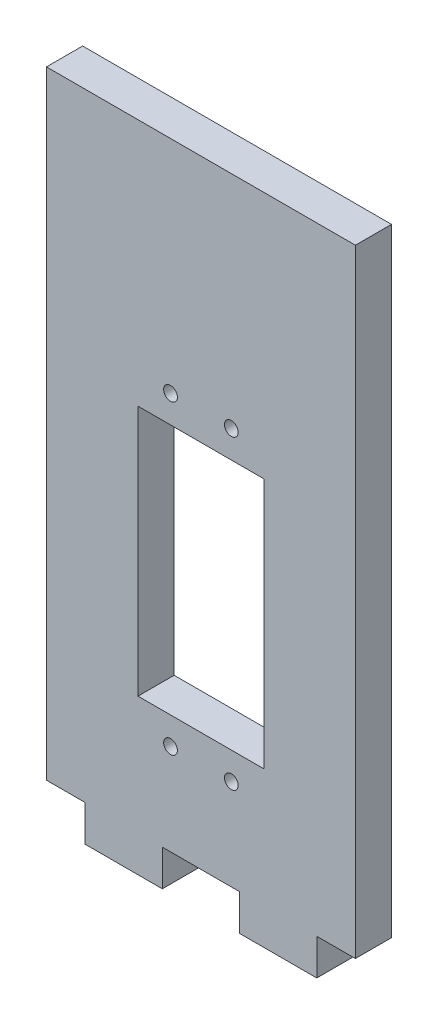
ISO-10303-21;
HEADER;
FILE_DESCRIPTION(('STEP AP214'),'2;1');
FILE_NAME('part.step','',(''),(''),'','','');
FILE_SCHEMA(('AUTOMOTIVE_DESIGN { 1 0 10303 214 1 1 1 1 }'));
ENDSEC;
DATA;
#1=APPLICATION_CONTEXT('core data for automotive mechanical design processes');
#2=APPLICATION_PROTOCOL_DEFINITION('international standard','automotive_design',2000,#1);
#3=PRODUCT_CONTEXT('',#1,'mechanical');
#4=PRODUCT('Part','Part','',(#3));
#5=PRODUCT_RELATED_PRODUCT_CATEGORY('part','',(#4));
#6=PRODUCT_DEFINITION_FORMATION('','',#4);
#7=PRODUCT_DEFINITION_CONTEXT('part definition',#1,'design');
#8=PRODUCT_DEFINITION('design','',#6,#7);
#9=PRODUCT_DEFINITION_SHAPE('','',#8);
#10=(LENGTH_UNIT() NAMED_UNIT(*) SI_UNIT(.MILLI.,.METRE.));
#11=(NAMED_UNIT(*) PLANE_ANGLE_UNIT() SI_UNIT($,.RADIAN.));
#12=(NAMED_UNIT(*) SI_UNIT($,.STERADIAN.) SOLID_ANGLE_UNIT());
#13=UNCERTAINTY_MEASURE_WITH_UNIT(LENGTH_MEASURE(1.E-05),#10,'distance_accuracy_value','');
#14=(GEOMETRIC_REPRESENTATION_CONTEXT(3) GLOBAL_UNCERTAINTY_ASSIGNED_CONTEXT((#13)) GLOBAL_UNIT_ASSIGNED_CONTEXT((#10,
#11,#12)) REPRESENTATION_CONTEXT('',''));
#15=CARTESIAN_POINT('',(0.,0.,0.));
#16=DIRECTION('',(0.,0.,1.));
#17=DIRECTION('',(1.,0.,0.));
#18=AXIS2_PLACEMENT_3D('',#15,#16,#17);
#19=CARTESIAN_POINT('',(0.,0.,5.9436));
#20=DIRECTION('',(1.,0.,0.));
#21=DIRECTION('',(0.,0.,-1.));
#22=AXIS2_PLACEMENT_3D('',#19,#20,#21);
#23=PLANE('',#22);
#24=DIRECTION('',(0.,-1.,0.));
#25=VECTOR('',#24,1.);
#26=CARTESIAN_POINT('',(0.,0.,0.));
#27=LINE('',#26,#25);
#28=CARTESIAN_POINT('',(0.,101.6,0.));
#29=VERTEX_POINT('',#28);
#30=CARTESIAN_POINT('',(0.,0.,0.));
#31=VERTEX_POINT('',#30);
#32=EDGE_CURVE('E181',#29,#31,#27,.T.);
#33=ORIENTED_EDGE('',*,*,#32,.T.);
#34=DIRECTION('',(0.,0.,-1.));
#35=VECTOR('',#34,1.);
#36=CARTESIAN_POINT('',(0.,0.,5.9436));
#37=LINE('',#36,#35);
#38=CARTESIAN_POINT('',(0.,0.,5.9436));
#39=VERTEX_POINT('',#38);
#40=EDGE_CURVE('E11',#39,#31,#37,.T.);
#41=ORIENTED_EDGE('',*,*,#40,.F.);
#42=DIRECTION('',(0.,-1.,0.));
#43=VECTOR('',#42,1.);
#44=CARTESIAN_POINT('',(0.,0.,5.9436));
#45=LINE('',#44,#43);
#46=CARTESIAN_POINT('',(0.,101.6,5.9436));
#47=VERTEX_POINT('',#46);
#48=EDGE_CURVE('E185',#47,#39,#45,.T.);
#49=ORIENTED_EDGE('',*,*,#48,.F.);
#50=DIRECTION('',(0.,0.,-1.));
#51=VECTOR('',#50,1.);
#52=CARTESIAN_POINT('',(0.,101.6,5.9436));
#53=LINE('',#52,#51);
#54=EDGE_CURVE('E211',#47,#29,#53,.T.);
#55=ORIENTED_EDGE('',*,*,#54,.T.);
#56=EDGE_LOOP('',(#33,#41,#49,#55));
#57=FACE_BOUND('',#56,.T.);
#58=ADVANCED_FACE('F32',(#57),#23,.F.);
#59=CARTESIAN_POINT('',(0.,0.,5.9436));
#60=DIRECTION('',(0.,1.,0.));
#61=DIRECTION('',(0.,0.,1.));
#62=AXIS2_PLACEMENT_3D('',#59,#60,#61);
#63=PLANE('',#62);
#64=DIRECTION('',(1.,0.,0.));
#65=VECTOR('',#64,1.);
#66=CARTESIAN_POINT('',(0.,0.,0.));
#67=LINE('',#66,#65);
#68=CARTESIAN_POINT('',(6.35,0.,0.));
#69=VERTEX_POINT('',#68);
#70=EDGE_CURVE('E214',#31,#69,#67,.T.);
#71=ORIENTED_EDGE('',*,*,#70,.T.);
#72=DIRECTION('',(0.,0.,-1.));
#73=VECTOR('',#72,1.);
#74=CARTESIAN_POINT('',(6.35,0.,5.9436));
#75=LINE('',#74,#73);
#76=CARTESIAN_POINT('',(6.35,0.,5.9436));
#77=VERTEX_POINT('',#76);
#78=EDGE_CURVE('E39',#77,#69,#75,.T.);
#79=ORIENTED_EDGE('',*,*,#78,.F.);
#80=DIRECTION('',(1.,0.,0.));
#81=VECTOR('',#80,1.);
#82=CARTESIAN_POINT('',(0.,0.,5.9436));
#83=LINE('',#82,#81);
#84=EDGE_CURVE('E188',#39,#77,#83,.T.);
#85=ORIENTED_EDGE('',*,*,#84,.F.);
#86=ORIENTED_EDGE('',*,*,#40,.T.);
#87=EDGE_LOOP('',(#71,#79,#85,#86));
#88=FACE_BOUND('',#87,.T.);
#89=ADVANCED_FACE('F289',(#88),#63,.F.);
#90=CARTESIAN_POINT('',(6.35,0.,5.9436));
#91=DIRECTION('',(1.,0.,0.));
#92=DIRECTION('',(0.,1.,0.));
#93=AXIS2_PLACEMENT_3D('',#90,#91,#92);
#94=PLANE('',#93);
#95=DIRECTION('',(0.,-1.,0.));
#96=VECTOR('',#95,1.);
#97=CARTESIAN_POINT('',(6.35,0.,0.));
#98=LINE('',#97,#96);
#99=CARTESIAN_POINT('',(6.35,-5.9436,0.));
#100=VERTEX_POINT('',#99);
#101=EDGE_CURVE('E216',#69,#100,#98,.T.);
#102=ORIENTED_EDGE('',*,*,#101,.T.);
#103=DIRECTION('',(0.,0.,-1.));
#104=VECTOR('',#103,1.);
#105=CARTESIAN_POINT('',(6.35,-5.9436,5.9436));
#106=LINE('',#105,#104);
#107=CARTESIAN_POINT('',(6.35,-5.9436,5.9436));
#108=VERTEX_POINT('',#107);
#109=EDGE_CURVE('E261',#108,#100,#106,.T.);
#110=ORIENTED_EDGE('',*,*,#109,.F.);
#111=DIRECTION('',(0.,-1.,0.));
#112=VECTOR('',#111,1.);
#113=CARTESIAN_POINT('',(6.35,0.,5.9436));
#114=LINE('',#113,#112);
#115=EDGE_CURVE('E191',#77,#108,#114,.T.);
#116=ORIENTED_EDGE('',*,*,#115,.F.);
#117=ORIENTED_EDGE('',*,*,#78,.T.);
#118=EDGE_LOOP('',(#102,#110,#116,#117));
#119=FACE_BOUND('',#118,.T.);
#120=ADVANCED_FACE('F268',(#119),#94,.F.);
#121=CARTESIAN_POINT('',(6.35,-5.9436,5.9436));
#122=DIRECTION('',(0.,1.,0.));
#123=DIRECTION('',(-1.,0.,0.));
#124=AXIS2_PLACEMENT_3D('',#121,#122,#123);
#125=PLANE('',#124);
#126=DIRECTION('',(1.,0.,0.));
#127=VECTOR('',#126,1.);
#128=CARTESIAN_POINT('',(6.35,-5.9436,0.));
#129=LINE('',#128,#127);
#130=CARTESIAN_POINT('',(19.05,-5.9436,0.));
#131=VERTEX_POINT('',#130);
#132=EDGE_CURVE('E218',#100,#131,#129,.T.);
#133=ORIENTED_EDGE('',*,*,#132,.T.);
#134=DIRECTION('',(0.,0.,-1.));
#135=VECTOR('',#134,1.);
#136=CARTESIAN_POINT('',(19.05,-5.9436,5.9436));
#137=LINE('',#136,#135);
#138=CARTESIAN_POINT('',(19.05,-5.9436,5.9436));
#139=VERTEX_POINT('',#138);
#140=EDGE_CURVE('E258',#139,#131,#137,.T.);
#141=ORIENTED_EDGE('',*,*,#140,.F.);
#142=DIRECTION('',(1.,0.,0.));
#143=VECTOR('',#142,1.);
#144=CARTESIAN_POINT('',(6.35,-5.9436,5.9436));
#145=LINE('',#144,#143);
#146=EDGE_CURVE('E193',#108,#139,#145,.T.);
#147=ORIENTED_EDGE('',*,*,#146,.F.);
#148=ORIENTED_EDGE('',*,*,#109,.T.);
#149=EDGE_LOOP('',(#133,#141,#147,#148));
#150=FACE_BOUND('',#149,.T.);
#151=ADVANCED_FACE('F277',(#150),#125,.F.);
#152=CARTESIAN_POINT('',(19.05,-5.9436,5.9436));
#153=DIRECTION('',(-1.,0.,0.));
#154=DIRECTION('',(0.,0.,1.));
#155=AXIS2_PLACEMENT_3D('',#152,#153,#154);
#156=PLANE('',#155);
#157=DIRECTION('',(0.,1.,0.));
#158=VECTOR('',#157,1.);
#159=CARTESIAN_POINT('',(19.05,-5.9436,0.));
#160=LINE('',#159,#158);
#161=CARTESIAN_POINT('',(19.05,0.,0.));
#162=VERTEX_POINT('',#161);
#163=EDGE_CURVE('E220',#131,#162,#160,.T.);
#164=ORIENTED_EDGE('',*,*,#163,.T.);
#165=DIRECTION('',(0.,0.,-1.));
#166=VECTOR('',#165,1.);
#167=CARTESIAN_POINT('',(19.05,0.,5.9436));
#168=LINE('',#167,#166);
#169=CARTESIAN_POINT('',(19.05,0.,5.9436));
#170=VERTEX_POINT('',#169);
#171=EDGE_CURVE('E255',#170,#162,#168,.T.);
#172=ORIENTED_EDGE('',*,*,#171,.F.);
#173=DIRECTION('',(0.,1.,0.));
#174=VECTOR('',#173,1.);
#175=CARTESIAN_POINT('',(19.05,-5.9436,5.9436));
#176=LINE('',#175,#174);
#177=EDGE_CURVE('E195',#139,#170,#176,.T.);
#178=ORIENTED_EDGE('',*,*,#177,.F.);
#179=ORIENTED_EDGE('',*,*,#140,.T.);
#180=EDGE_LOOP('',(#164,#172,#178,#179));
#181=FACE_BOUND('',#180,.T.);
#182=ADVANCED_FACE('F281',(#181),#156,.F.);
#183=CARTESIAN_POINT('',(19.05,0.,5.9436));
#184=DIRECTION('',(0.,1.,0.));
#185=DIRECTION('',(0.,0.,1.));
#186=AXIS2_PLACEMENT_3D('',#183,#184,#185);
#187=PLANE('',#186);
#188=DIRECTION('',(1.,0.,0.));
#189=VECTOR('',#188,1.);
#190=CARTESIAN_POINT('',(19.05,0.,0.));
#191=LINE('',#190,#189);
#192=CARTESIAN_POINT('',(31.75,0.,0.));
#193=VERTEX_POINT('',#192);
#194=EDGE_CURVE('E222',#162,#193,#191,.T.);
#195=ORIENTED_EDGE('',*,*,#194,.T.);
#196=DIRECTION('',(0.,0.,-1.));
#197=VECTOR('',#196,1.);
#198=CARTESIAN_POINT('',(31.75,0.,5.9436));
#199=LINE('',#198,#197);
#200=CARTESIAN_POINT('',(31.75,0.,5.9436));
#201=VERTEX_POINT('',#200);
#202=EDGE_CURVE('E252',#201,#193,#199,.T.);
#203=ORIENTED_EDGE('',*,*,#202,.F.);
#204=DIRECTION('',(1.,0.,0.));
#205=VECTOR('',#204,1.);
#206=CARTESIAN_POINT('',(19.05,0.,5.9436));
#207=LINE('',#206,#205);
#208=EDGE_CURVE('E197',#170,#201,#207,.T.);
#209=ORIENTED_EDGE('',*,*,#208,.F.);
#210=ORIENTED_EDGE('',*,*,#171,.T.);
#211=EDGE_LOOP('',(#195,#203,#209,#210));
#212=FACE_BOUND('',#211,.T.);
#213=ADVANCED_FACE('F322',(#212),#187,.F.);
#214=CARTESIAN_POINT('',(31.75,-5.9436,5.9436));
#215=DIRECTION('',(1.,0.,0.));
#216=DIRECTION('',(0.,0.,-1.));
#217=AXIS2_PLACEMENT_3D('',#214,#215,#216);
#218=PLANE('',#217);
#219=DIRECTION('',(0.,-1.,0.));
#220=VECTOR('',#219,1.);
#221=CARTESIAN_POINT('',(31.75,-5.9436,0.));
#222=LINE('',#221,#220);
#223=CARTESIAN_POINT('',(31.75,-5.9436,0.));
#224=VERTEX_POINT('',#223);
#225=EDGE_CURVE('E224',#193,#224,#222,.T.);
#226=ORIENTED_EDGE('',*,*,#225,.T.);
#227=DIRECTION('',(0.,0.,-1.));
#228=VECTOR('',#227,1.);
#229=CARTESIAN_POINT('',(31.75,-5.9436,5.9436));
#230=LINE('',#229,#228);
#231=CARTESIAN_POINT('',(31.75,-5.9436,5.9436));
#232=VERTEX_POINT('',#231);
#233=EDGE_CURVE('E249',#232,#224,#230,.T.);
#234=ORIENTED_EDGE('',*,*,#233,.F.);
#235=DIRECTION('',(0.,-1.,0.));
#236=VECTOR('',#235,1.);
#237=CARTESIAN_POINT('',(31.75,-5.9436,5.9436));
#238=LINE('',#237,#236);
#239=EDGE_CURVE('E199',#201,#232,#238,.T.);
#240=ORIENTED_EDGE('',*,*,#239,.F.);
#241=ORIENTED_EDGE('',*,*,#202,.T.);
#242=EDGE_LOOP('',(#226,#234,#240,#241));
#243=FACE_BOUND('',#242,.T.);
#244=ADVANCED_FACE('F320',(#243),#218,.F.);
#245=CARTESIAN_POINT('',(44.45,-5.9436,5.9436));
#246=DIRECTION('',(0.,1.,0.));
#247=DIRECTION('',(-1.,0.,0.));
#248=AXIS2_PLACEMENT_3D('',#245,#246,#247);
#249=PLANE('',#248);
#250=DIRECTION('',(1.,0.,0.));
#251=VECTOR('',#250,1.);
#252=CARTESIAN_POINT('',(44.45,-5.9436,0.));
#253=LINE('',#252,#251);
#254=CARTESIAN_POINT('',(44.45,-5.9436,0.));
#255=VERTEX_POINT('',#254);
#256=EDGE_CURVE('E226',#224,#255,#253,.T.);
#257=ORIENTED_EDGE('',*,*,#256,.T.);
#258=DIRECTION('',(0.,0.,-1.));
#259=VECTOR('',#258,1.);
#260=CARTESIAN_POINT('',(44.45,-5.9436,5.9436));
#261=LINE('',#260,#259);
#262=CARTESIAN_POINT('',(44.45,-5.9436,5.9436));
#263=VERTEX_POINT('',#262);
#264=EDGE_CURVE('E246',#263,#255,#261,.T.);
#265=ORIENTED_EDGE('',*,*,#264,.F.);
#266=DIRECTION('',(1.,0.,0.));
#267=VECTOR('',#266,1.);
#268=CARTESIAN_POINT('',(44.45,-5.9436,5.9436));
#269=LINE('',#268,#267);
#270=EDGE_CURVE('E201',#232,#263,#269,.T.);
#271=ORIENTED_EDGE('',*,*,#270,.F.);
#272=ORIENTED_EDGE('',*,*,#233,.T.);
#273=EDGE_LOOP('',(#257,#265,#271,#272));
#274=FACE_BOUND('',#273,.T.);
#275=ADVANCED_FACE('F316',(#274),#249,.F.);
#276=CARTESIAN_POINT('',(44.45,0.,5.9436));
#277=DIRECTION('',(-1.,0.,0.));
#278=DIRECTION('',(0.,0.,1.));
#279=AXIS2_PLACEMENT_3D('',#276,#277,#278);
#280=PLANE('',#279);
#281=DIRECTION('',(0.,1.,0.));
#282=VECTOR('',#281,1.);
#283=CARTESIAN_POINT('',(44.45,0.,0.));
#284=LINE('',#283,#282);
#285=CARTESIAN_POINT('',(44.45,0.,0.));
#286=VERTEX_POINT('',#285);
#287=EDGE_CURVE('E228',#255,#286,#284,.T.);
#288=ORIENTED_EDGE('',*,*,#287,.T.);
#289=DIRECTION('',(0.,0.,-1.));
#290=VECTOR('',#289,1.);
#291=CARTESIAN_POINT('',(44.45,0.,5.9436));
#292=LINE('',#291,#290);
#293=CARTESIAN_POINT('',(44.45,0.,5.9436));
#294=VERTEX_POINT('',#293);
#295=EDGE_CURVE('E243',#294,#286,#292,.T.);
#296=ORIENTED_EDGE('',*,*,#295,.F.);
#297=DIRECTION('',(0.,1.,0.));
#298=VECTOR('',#297,1.);
#299=CARTESIAN_POINT('',(44.45,0.,5.9436));
#300=LINE('',#299,#298);
#301=EDGE_CURVE('E203',#263,#294,#300,.T.);
#302=ORIENTED_EDGE('',*,*,#301,.F.);
#303=ORIENTED_EDGE('',*,*,#264,.T.);
#304=EDGE_LOOP('',(#288,#296,#302,#303));
#305=FACE_BOUND('',#304,.T.);
#306=ADVANCED_FACE('F311',(#305),#280,.F.);
#307=CARTESIAN_POINT('',(44.45,0.,5.9436));
#308=DIRECTION('',(0.,1.,0.));
#309=DIRECTION('',(0.,0.,1.));
#310=AXIS2_PLACEMENT_3D('',#307,#308,#309);
#311=PLANE('',#310);
#312=DIRECTION('',(1.,0.,0.));
#313=VECTOR('',#312,1.);
#314=CARTESIAN_POINT('',(44.45,0.,0.));
#315=LINE('',#314,#313);
#316=CARTESIAN_POINT('',(50.8,0.,0.));
#317=VERTEX_POINT('',#316);
#318=EDGE_CURVE('E230',#286,#317,#315,.T.);
#319=ORIENTED_EDGE('',*,*,#318,.T.);
#320=DIRECTION('',(0.,0.,-1.));
#321=VECTOR('',#320,1.);
#322=CARTESIAN_POINT('',(50.8,0.,5.9436));
#323=LINE('',#322,#321);
#324=CARTESIAN_POINT('',(50.8,0.,5.9436));
#325=VERTEX_POINT('',#324);
#326=EDGE_CURVE('E240',#325,#317,#323,.T.);
#327=ORIENTED_EDGE('',*,*,#326,.F.);
#328=DIRECTION('',(1.,0.,0.));
#329=VECTOR('',#328,1.);
#330=CARTESIAN_POINT('',(44.45,0.,5.9436));
#331=LINE('',#330,#329);
#332=EDGE_CURVE('E205',#294,#325,#331,.T.);
#333=ORIENTED_EDGE('',*,*,#332,.F.);
#334=ORIENTED_EDGE('',*,*,#295,.T.);
#335=EDGE_LOOP('',(#319,#327,#333,#334));
#336=FACE_BOUND('',#335,.T.);
#337=ADVANCED_FACE('F305',(#336),#311,.F.);
#338=CARTESIAN_POINT('',(50.8,0.,5.9436));
#339=DIRECTION('',(-1.,0.,0.));
#340=DIRECTION('',(0.,-1.,0.));
#341=AXIS2_PLACEMENT_3D('',#338,#339,#340);
#342=PLANE('',#341);
#343=DIRECTION('',(0.,1.,0.));
#344=VECTOR('',#343,1.);
#345=CARTESIAN_POINT('',(50.8,0.,0.));
#346=LINE('',#345,#344);
#347=CARTESIAN_POINT('',(50.8,101.6,0.));
#348=VERTEX_POINT('',#347);
#349=EDGE_CURVE('E232',#317,#348,#346,.T.);
#350=ORIENTED_EDGE('',*,*,#349,.T.);
#351=DIRECTION('',(0.,0.,-1.));
#352=VECTOR('',#351,1.);
#353=CARTESIAN_POINT('',(50.8,101.6,5.9436));
#354=LINE('',#353,#352);
#355=CARTESIAN_POINT('',(50.8,101.6,5.9436));
#356=VERTEX_POINT('',#355);
#357=EDGE_CURVE('E237',#356,#348,#354,.T.);
#358=ORIENTED_EDGE('',*,*,#357,.F.);
#359=DIRECTION('',(0.,1.,0.));
#360=VECTOR('',#359,1.);
#361=CARTESIAN_POINT('',(50.8,0.,5.9436));
#362=LINE('',#361,#360);
#363=EDGE_CURVE('E207',#325,#356,#362,.T.);
#364=ORIENTED_EDGE('',*,*,#363,.F.);
#365=ORIENTED_EDGE('',*,*,#326,.T.);
#366=EDGE_LOOP('',(#350,#358,#364,#365));
#367=FACE_BOUND('',#366,.T.);
#368=ADVANCED_FACE('F301',(#367),#342,.F.);
#369=CARTESIAN_POINT('',(0.,101.6,5.9436));
#370=DIRECTION('',(0.,-1.,0.));
#371=DIRECTION('',(0.,0.,-1.));
#372=AXIS2_PLACEMENT_3D('',#369,#370,#371);
#373=PLANE('',#372);
#374=DIRECTION('',(-1.,0.,0.));
#375=VECTOR('',#374,1.);
#376=CARTESIAN_POINT('',(0.,101.6,0.));
#377=LINE('',#376,#375);
#378=EDGE_CURVE('E189',#348,#29,#377,.T.);
#379=ORIENTED_EDGE('',*,*,#378,.T.);
#380=ORIENTED_EDGE('',*,*,#54,.F.);
#381=DIRECTION('',(-1.,0.,0.));
#382=VECTOR('',#381,1.);
#383=CARTESIAN_POINT('',(0.,101.6,5.9436));
#384=LINE('',#383,#382);
#385=EDGE_CURVE('E209',#356,#47,#384,.T.);
#386=ORIENTED_EDGE('',*,*,#385,.F.);
#387=ORIENTED_EDGE('',*,*,#357,.T.);
#388=EDGE_LOOP('',(#379,#380,#386,#387));
#389=FACE_BOUND('',#388,.T.);
#390=ADVANCED_FACE('F296',(#389),#373,.F.);
#391=CARTESIAN_POINT('',(0.,0.,5.9436));
#392=DIRECTION('',(0.,0.,-1.));
#393=DIRECTION('',(-1.,0.,0.));
#394=AXIS2_PLACEMENT_3D('',#391,#392,#393);
#395=PLANE('',#394);
#396=CARTESIAN_POINT('',(30.4,15.,5.9436));
#397=DIRECTION('',(0.,0.,1.));
#398=DIRECTION('',(1.,0.,0.));
#399=AXIS2_PLACEMENT_3D('',#396,#397,#398);
#400=CIRCLE('',#399,1.13030000000002);
#401=CARTESIAN_POINT('',(31.5303,15.,5.9436));
#402=VERTEX_POINT('',#401);
#403=EDGE_CURVE('E168',#402,#402,#400,.T.);
#404=ORIENTED_EDGE('',*,*,#403,.F.);
#405=EDGE_LOOP('',(#404));
#406=FACE_BOUND('',#405,.T.);
#407=CARTESIAN_POINT('',(20.4,15.,5.9436));
#408=DIRECTION('',(0.,0.,1.));
#409=DIRECTION('',(1.,0.,0.));
#410=AXIS2_PLACEMENT_3D('',#407,#408,#409);
#411=CIRCLE('',#410,1.1303);
#412=CARTESIAN_POINT('',(21.5303,15.,5.9436));
#413=VERTEX_POINT('',#412);
#414=EDGE_CURVE('E502',#413,#413,#411,.T.);
#415=ORIENTED_EDGE('',*,*,#414,.F.);
#416=EDGE_LOOP('',(#415));
#417=FACE_BOUND('',#416,.T.);
#418=CARTESIAN_POINT('',(30.4,65.3,5.9436));
#419=DIRECTION('',(0.,0.,1.));
#420=DIRECTION('',(1.,0.,0.));
#421=AXIS2_PLACEMENT_3D('',#418,#419,#420);
#422=CIRCLE('',#421,1.13030000000002);
#423=CARTESIAN_POINT('',(31.5303,65.3,5.9436));
#424=VERTEX_POINT('',#423);
#425=EDGE_CURVE('E509',#424,#424,#422,.T.);
#426=ORIENTED_EDGE('',*,*,#425,.F.);
#427=EDGE_LOOP('',(#426));
#428=FACE_BOUND('',#427,.T.);
#429=CARTESIAN_POINT('',(20.4,65.3,5.9436));
#430=DIRECTION('',(0.,0.,1.));
#431=DIRECTION('',(1.,0.,0.));
#432=AXIS2_PLACEMENT_3D('',#429,#430,#431);
#433=CIRCLE('',#432,1.1303);
#434=CARTESIAN_POINT('',(21.5303,65.3,5.9436));
#435=VERTEX_POINT('',#434);
#436=EDGE_CURVE('E515',#435,#435,#433,.T.);
#437=ORIENTED_EDGE('',*,*,#436,.F.);
#438=EDGE_LOOP('',(#437));
#439=FACE_BOUND('',#438,.T.);
#440=DIRECTION('',(1.,0.,0.));
#441=VECTOR('',#440,1.);
#442=CARTESIAN_POINT('',(15.05,19.5,5.9436));
#443=LINE('',#442,#441);
#444=CARTESIAN_POINT('',(15.05,19.5,5.9436));
#445=VERTEX_POINT('',#444);
#446=CARTESIAN_POINT('',(35.75,19.5,5.9436));
#447=VERTEX_POINT('',#446);
#448=EDGE_CURVE('E174',#445,#447,#443,.T.);
#449=ORIENTED_EDGE('',*,*,#448,.F.);
#450=DIRECTION('',(0.,-1.,0.));
#451=VECTOR('',#450,1.);
#452=CARTESIAN_POINT('',(15.05,60.8000000000001,5.9436));
#453=LINE('',#452,#451);
#454=CARTESIAN_POINT('',(15.05,60.8000000000001,5.9436));
#455=VERTEX_POINT('',#454);
#456=EDGE_CURVE('E46',#455,#445,#453,.T.);
#457=ORIENTED_EDGE('',*,*,#456,.F.);
#458=DIRECTION('',(-1.,0.,0.));
#459=VECTOR('',#458,1.);
#460=CARTESIAN_POINT('',(15.05,60.8000000000001,5.9436));
#461=LINE('',#460,#459);
#462=CARTESIAN_POINT('',(35.75,60.8000000000001,5.9436));
#463=VERTEX_POINT('',#462);
#464=EDGE_CURVE('E162',#463,#455,#461,.T.);
#465=ORIENTED_EDGE('',*,*,#464,.F.);
#466=DIRECTION('',(0.,1.,0.));
#467=VECTOR('',#466,1.);
#468=CARTESIAN_POINT('',(35.75,60.8000000000001,5.9436));
#469=LINE('',#468,#467);
#470=EDGE_CURVE('E165',#447,#463,#469,.T.);
#471=ORIENTED_EDGE('',*,*,#470,.F.);
#472=EDGE_LOOP('',(#449,#457,#465,#471));
#473=FACE_BOUND('',#472,.T.);
#474=ORIENTED_EDGE('',*,*,#48,.T.);
#475=ORIENTED_EDGE('',*,*,#84,.T.);
#476=ORIENTED_EDGE('',*,*,#115,.T.);
#477=ORIENTED_EDGE('',*,*,#146,.T.);
#478=ORIENTED_EDGE('',*,*,#177,.T.);
#479=ORIENTED_EDGE('',*,*,#208,.T.);
#480=ORIENTED_EDGE('',*,*,#239,.T.);
#481=ORIENTED_EDGE('',*,*,#270,.T.);
#482=ORIENTED_EDGE('',*,*,#301,.T.);
#483=ORIENTED_EDGE('',*,*,#332,.T.);
#484=ORIENTED_EDGE('',*,*,#363,.T.);
#485=ORIENTED_EDGE('',*,*,#385,.T.);
#486=EDGE_LOOP('',(#474,#475,#476,#477,#478,#479,#480,#481,#482,#483,#484,#485));
#487=FACE_BOUND('',#486,.T.);
#488=ADVANCED_FACE('F285',(#406,#417,#428,#439,#473,#487),#395,.F.);
#489=CARTESIAN_POINT('',(0.,0.,0.));
#490=DIRECTION('',(0.,0.,-1.));
#491=DIRECTION('',(-1.,0.,0.));
#492=AXIS2_PLACEMENT_3D('',#489,#490,#491);
#493=PLANE('',#492);
#494=CARTESIAN_POINT('',(30.4,15.,0.));
#495=DIRECTION('',(0.,0.,1.));
#496=DIRECTION('',(1.,0.,0.));
#497=AXIS2_PLACEMENT_3D('',#494,#495,#496);
#498=CIRCLE('',#497,1.13030000000002);
#499=CARTESIAN_POINT('',(31.5303,15.,0.));
#500=VERTEX_POINT('',#499);
#501=EDGE_CURVE('E499',#500,#500,#498,.T.);
#502=ORIENTED_EDGE('',*,*,#501,.T.);
#503=EDGE_LOOP('',(#502));
#504=FACE_BOUND('',#503,.T.);
#505=CARTESIAN_POINT('',(20.4,15.,0.));
#506=DIRECTION('',(0.,0.,1.));
#507=DIRECTION('',(1.,0.,0.));
#508=AXIS2_PLACEMENT_3D('',#505,#506,#507);
#509=CIRCLE('',#508,1.1303);
#510=CARTESIAN_POINT('',(21.5303,15.,0.));
#511=VERTEX_POINT('',#510);
#512=EDGE_CURVE('E504',#511,#511,#509,.T.);
#513=ORIENTED_EDGE('',*,*,#512,.T.);
#514=EDGE_LOOP('',(#513));
#515=FACE_BOUND('',#514,.T.);
#516=CARTESIAN_POINT('',(30.4,65.3,0.));
#517=DIRECTION('',(0.,0.,1.));
#518=DIRECTION('',(1.,0.,0.));
#519=AXIS2_PLACEMENT_3D('',#516,#517,#518);
#520=CIRCLE('',#519,1.13030000000002);
#521=CARTESIAN_POINT('',(31.5303,65.3,0.));
#522=VERTEX_POINT('',#521);
#523=EDGE_CURVE('E512',#522,#522,#520,.T.);
#524=ORIENTED_EDGE('',*,*,#523,.T.);
#525=EDGE_LOOP('',(#524));
#526=FACE_BOUND('',#525,.T.);
#527=CARTESIAN_POINT('',(20.4,65.3,0.));
#528=DIRECTION('',(0.,0.,1.));
#529=DIRECTION('',(1.,0.,0.));
#530=AXIS2_PLACEMENT_3D('',#527,#528,#529);
#531=CIRCLE('',#530,1.1303);
#532=CARTESIAN_POINT('',(21.5303,65.3,0.));
#533=VERTEX_POINT('',#532);
#534=EDGE_CURVE('E175',#533,#533,#531,.T.);
#535=ORIENTED_EDGE('',*,*,#534,.T.);
#536=EDGE_LOOP('',(#535));
#537=FACE_BOUND('',#536,.T.);
#538=DIRECTION('',(0.,-1.,0.));
#539=VECTOR('',#538,1.);
#540=CARTESIAN_POINT('',(15.05,60.8000000000001,0.));
#541=LINE('',#540,#539);
#542=CARTESIAN_POINT('',(15.05,60.8000000000001,0.));
#543=VERTEX_POINT('',#542);
#544=CARTESIAN_POINT('',(15.05,19.5,0.));
#545=VERTEX_POINT('',#544);
#546=EDGE_CURVE('E146',#543,#545,#541,.T.);
#547=ORIENTED_EDGE('',*,*,#546,.T.);
#548=DIRECTION('',(1.,0.,0.));
#549=VECTOR('',#548,1.);
#550=CARTESIAN_POINT('',(15.05,19.5,0.));
#551=LINE('',#550,#549);
#552=CARTESIAN_POINT('',(35.75,19.5,0.));
#553=VERTEX_POINT('',#552);
#554=EDGE_CURVE('E155',#545,#553,#551,.T.);
#555=ORIENTED_EDGE('',*,*,#554,.T.);
#556=DIRECTION('',(0.,1.,0.));
#557=VECTOR('',#556,1.);
#558=CARTESIAN_POINT('',(35.75,60.8000000000001,0.));
#559=LINE('',#558,#557);
#560=CARTESIAN_POINT('',(35.75,60.8000000000001,0.));
#561=VERTEX_POINT('',#560);
#562=EDGE_CURVE('E54',#553,#561,#559,.T.);
#563=ORIENTED_EDGE('',*,*,#562,.T.);
#564=DIRECTION('',(-1.,0.,0.));
#565=VECTOR('',#564,1.);
#566=CARTESIAN_POINT('',(15.05,60.8000000000001,0.));
#567=LINE('',#566,#565);
#568=EDGE_CURVE('E152',#561,#543,#567,.T.);
#569=ORIENTED_EDGE('',*,*,#568,.T.);
#570=EDGE_LOOP('',(#547,#555,#563,#569));
#571=FACE_BOUND('',#570,.T.);
#572=ORIENTED_EDGE('',*,*,#32,.F.);
#573=ORIENTED_EDGE('',*,*,#378,.F.);
#574=ORIENTED_EDGE('',*,*,#349,.F.);
#575=ORIENTED_EDGE('',*,*,#318,.F.);
#576=ORIENTED_EDGE('',*,*,#287,.F.);
#577=ORIENTED_EDGE('',*,*,#256,.F.);
#578=ORIENTED_EDGE('',*,*,#225,.F.);
#579=ORIENTED_EDGE('',*,*,#194,.F.);
#580=ORIENTED_EDGE('',*,*,#163,.F.);
#581=ORIENTED_EDGE('',*,*,#132,.F.);
#582=ORIENTED_EDGE('',*,*,#101,.F.);
#583=ORIENTED_EDGE('',*,*,#70,.F.);
#584=EDGE_LOOP('',(#572,#573,#574,#575,#576,#577,#578,#579,#580,#581,#582,#583));
#585=FACE_BOUND('',#584,.T.);
#586=ADVANCED_FACE('F159',(#504,#515,#526,#537,#571,#585),#493,.T.);
#587=CARTESIAN_POINT('',(15.05,60.8000000000001,0.));
#588=DIRECTION('',(-1.,0.,0.));
#589=DIRECTION('',(0.,0.,1.));
#590=AXIS2_PLACEMENT_3D('',#587,#588,#589);
#591=PLANE('',#590);
#592=ORIENTED_EDGE('',*,*,#456,.T.);
#593=DIRECTION('',(0.,0.,1.));
#594=VECTOR('',#593,1.);
#595=CARTESIAN_POINT('',(15.05,19.5,0.));
#596=LINE('',#595,#594);
#597=EDGE_CURVE('E142',#545,#445,#596,.T.);
#598=ORIENTED_EDGE('',*,*,#597,.F.);
#599=ORIENTED_EDGE('',*,*,#546,.F.);
#600=DIRECTION('',(0.,0.,1.));
#601=VECTOR('',#600,1.);
#602=CARTESIAN_POINT('',(15.05,60.8000000000001,0.));
#603=LINE('',#602,#601);
#604=EDGE_CURVE('E179',#543,#455,#603,.T.);
#605=ORIENTED_EDGE('',*,*,#604,.T.);
#606=EDGE_LOOP('',(#592,#598,#599,#605));
#607=FACE_BOUND('',#606,.T.);
#608=ADVANCED_FACE('F144',(#607),#591,.F.);
#609=CARTESIAN_POINT('',(15.05,60.8000000000001,0.));
#610=DIRECTION('',(0.,1.,0.));
#611=DIRECTION('',(0.,0.,1.));
#612=AXIS2_PLACEMENT_3D('',#609,#610,#611);
#613=PLANE('',#612);
#614=ORIENTED_EDGE('',*,*,#464,.T.);
#615=ORIENTED_EDGE('',*,*,#604,.F.);
#616=ORIENTED_EDGE('',*,*,#568,.F.);
#617=DIRECTION('',(0.,0.,1.));
#618=VECTOR('',#617,1.);
#619=CARTESIAN_POINT('',(35.75,60.8000000000001,0.));
#620=LINE('',#619,#618);
#621=EDGE_CURVE('E182',#561,#463,#620,.T.);
#622=ORIENTED_EDGE('',*,*,#621,.T.);
#623=EDGE_LOOP('',(#614,#615,#616,#622));
#624=FACE_BOUND('',#623,.T.);
#625=ADVANCED_FACE('F426',(#624),#613,.F.);
#626=CARTESIAN_POINT('',(35.75,60.8000000000001,0.));
#627=DIRECTION('',(1.,0.,0.));
#628=DIRECTION('',(0.,0.,-1.));
#629=AXIS2_PLACEMENT_3D('',#626,#627,#628);
#630=PLANE('',#629);
#631=ORIENTED_EDGE('',*,*,#470,.T.);
#632=ORIENTED_EDGE('',*,*,#621,.F.);
#633=ORIENTED_EDGE('',*,*,#562,.F.);
#634=DIRECTION('',(0.,0.,1.));
#635=VECTOR('',#634,1.);
#636=CARTESIAN_POINT('',(35.75,19.5,0.));
#637=LINE('',#636,#635);
#638=EDGE_CURVE('E151',#553,#447,#637,.T.);
#639=ORIENTED_EDGE('',*,*,#638,.T.);
#640=EDGE_LOOP('',(#631,#632,#633,#639));
#641=FACE_BOUND('',#640,.T.);
#642=ADVANCED_FACE('F435',(#641),#630,.F.);
#643=CARTESIAN_POINT('',(15.05,19.5,0.));
#644=DIRECTION('',(0.,-1.,0.));
#645=DIRECTION('',(0.,0.,-1.));
#646=AXIS2_PLACEMENT_3D('',#643,#644,#645);
#647=PLANE('',#646);
#648=ORIENTED_EDGE('',*,*,#448,.T.);
#649=ORIENTED_EDGE('',*,*,#638,.F.);
#650=ORIENTED_EDGE('',*,*,#554,.F.);
#651=ORIENTED_EDGE('',*,*,#597,.T.);
#652=EDGE_LOOP('',(#648,#649,#650,#651));
#653=FACE_BOUND('',#652,.T.);
#654=ADVANCED_FACE('F156',(#653),#647,.F.);
#655=CARTESIAN_POINT('',(20.4,65.3,0.));
#656=DIRECTION('',(0.,0.,1.));
#657=DIRECTION('',(1.,0.,0.));
#658=AXIS2_PLACEMENT_3D('',#655,#656,#657);
#659=CYLINDRICAL_SURFACE('',#658,1.1303);
#660=ORIENTED_EDGE('',*,*,#534,.F.);
#661=EDGE_LOOP('',(#660));
#662=FACE_BOUND('',#661,.T.);
#663=ORIENTED_EDGE('',*,*,#436,.T.);
#664=EDGE_LOOP('',(#663));
#665=FACE_BOUND('',#664,.T.);
#666=ADVANCED_FACE('F453',(#662,#665),#659,.F.);
#667=CARTESIAN_POINT('',(30.4,65.3,0.));
#668=DIRECTION('',(0.,0.,1.));
#669=DIRECTION('',(1.,0.,0.));
#670=AXIS2_PLACEMENT_3D('',#667,#668,#669);
#671=CYLINDRICAL_SURFACE('',#670,1.13030000000002);
#672=ORIENTED_EDGE('',*,*,#523,.F.);
#673=EDGE_LOOP('',(#672));
#674=FACE_BOUND('',#673,.T.);
#675=ORIENTED_EDGE('',*,*,#425,.T.);
#676=EDGE_LOOP('',(#675));
#677=FACE_BOUND('',#676,.T.);
#678=ADVANCED_FACE('F462',(#674,#677),#671,.F.);
#679=CARTESIAN_POINT('',(20.4,15.,0.));
#680=DIRECTION('',(0.,0.,1.));
#681=DIRECTION('',(1.,0.,0.));
#682=AXIS2_PLACEMENT_3D('',#679,#680,#681);
#683=CYLINDRICAL_SURFACE('',#682,1.1303);
#684=ORIENTED_EDGE('',*,*,#512,.F.);
#685=EDGE_LOOP('',(#684));
#686=FACE_BOUND('',#685,.T.);
#687=ORIENTED_EDGE('',*,*,#414,.T.);
#688=EDGE_LOOP('',(#687));
#689=FACE_BOUND('',#688,.T.);
#690=ADVANCED_FACE('F472',(#686,#689),#683,.F.);
#691=CARTESIAN_POINT('',(30.4,15.,0.));
#692=DIRECTION('',(0.,0.,1.));
#693=DIRECTION('',(1.,0.,0.));
#694=AXIS2_PLACEMENT_3D('',#691,#692,#693);
#695=CYLINDRICAL_SURFACE('',#694,1.13030000000002);
#696=ORIENTED_EDGE('',*,*,#501,.F.);
#697=EDGE_LOOP('',(#696));
#698=FACE_BOUND('',#697,.T.);
#699=ORIENTED_EDGE('',*,*,#403,.T.);
#700=EDGE_LOOP('',(#699));
#701=FACE_BOUND('',#700,.T.);
#702=ADVANCED_FACE('F482',(#698,#701),#695,.F.);
#703=CLOSED_SHELL('',(#58,#89,#120,#151,#182,#213,#244,#275,#306,#337,#368,#390,#488,#586,#608,
#625,#642,#654,#666,#678,#690,#702));
#704=MANIFOLD_SOLID_BREP('B2',#703);
#705=ADVANCED_BREP_SHAPE_REPRESENTATION('',(#18,#704),#14);
#706=SHAPE_DEFINITION_REPRESENTATION(#9,#705);
ENDSEC;
END-ISO-10303-21;
